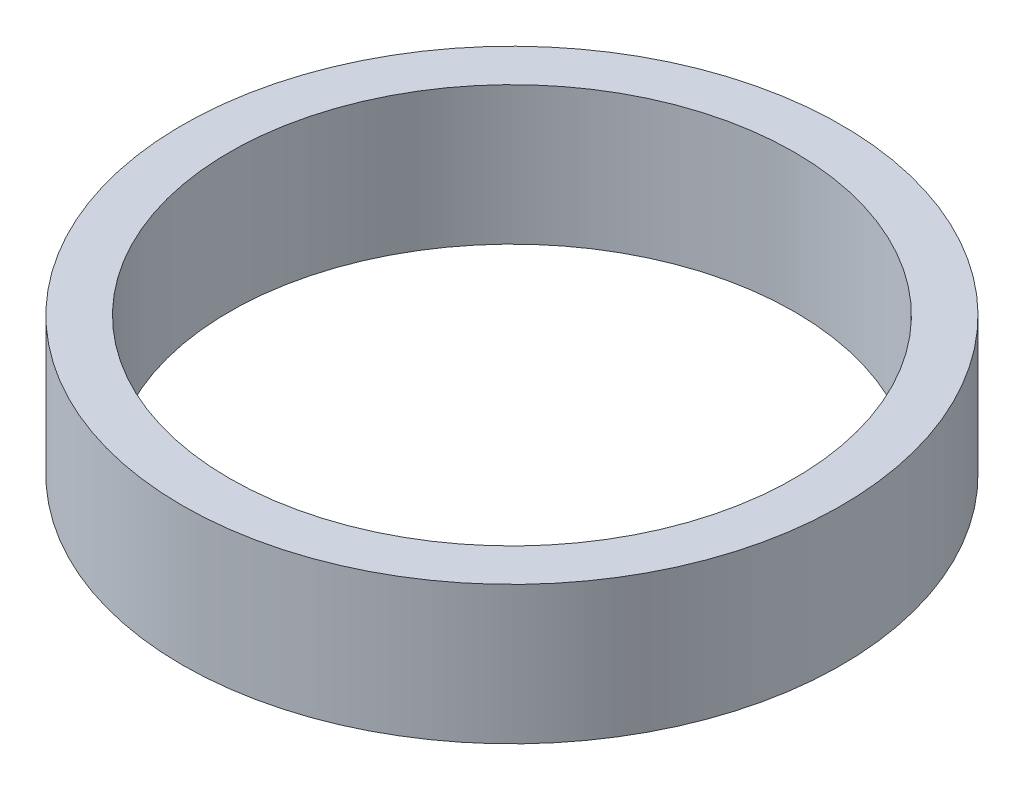
ISO-10303-21;
HEADER;
FILE_DESCRIPTION(('STEP AP214'),'2;1');
FILE_NAME('part.step','',(''),(''),'','','');
FILE_SCHEMA(('AUTOMOTIVE_DESIGN { 1 0 10303 214 1 1 1 1 }'));
ENDSEC;
DATA;
#1=APPLICATION_CONTEXT('core data for automotive mechanical design processes');
#2=APPLICATION_PROTOCOL_DEFINITION('international standard','automotive_design',2000,#1);
#3=PRODUCT_CONTEXT('',#1,'mechanical');
#4=PRODUCT('Part','Part','',(#3));
#5=PRODUCT_RELATED_PRODUCT_CATEGORY('part','',(#4));
#6=PRODUCT_DEFINITION_FORMATION('','',#4);
#7=PRODUCT_DEFINITION_CONTEXT('part definition',#1,'design');
#8=PRODUCT_DEFINITION('design','',#6,#7);
#9=PRODUCT_DEFINITION_SHAPE('','',#8);
#10=(LENGTH_UNIT() NAMED_UNIT(*) SI_UNIT(.MILLI.,.METRE.));
#11=(NAMED_UNIT(*) PLANE_ANGLE_UNIT() SI_UNIT($,.RADIAN.));
#12=(NAMED_UNIT(*) SI_UNIT($,.STERADIAN.) SOLID_ANGLE_UNIT());
#13=UNCERTAINTY_MEASURE_WITH_UNIT(LENGTH_MEASURE(1.E-05),#10,'distance_accuracy_value','');
#14=(GEOMETRIC_REPRESENTATION_CONTEXT(3) GLOBAL_UNCERTAINTY_ASSIGNED_CONTEXT((#13)) GLOBAL_UNIT_ASSIGNED_CONTEXT((#10,
#11,#12)) REPRESENTATION_CONTEXT('',''));
#15=CARTESIAN_POINT('',(0.,0.,0.));
#16=DIRECTION('',(0.,0.,1.));
#17=DIRECTION('',(1.,0.,0.));
#18=AXIS2_PLACEMENT_3D('',#15,#16,#17);
#19=CARTESIAN_POINT('',(0.,22.,0.));
#20=DIRECTION('',(0.,-1.,0.));
#21=DIRECTION('',(0.,0.,-1.));
#22=AXIS2_PLACEMENT_3D('',#19,#20,#21);
#23=CYLINDRICAL_SURFACE('',#22,52.5);
#24=CARTESIAN_POINT('',(0.,22.,0.));
#25=DIRECTION('',(0.,1.,0.));
#26=DIRECTION('',(0.,0.,1.));
#27=AXIS2_PLACEMENT_3D('',#24,#25,#26);
#28=CIRCLE('',#27,52.5);
#29=CARTESIAN_POINT('',(0.,22.,52.5));
#30=VERTEX_POINT('',#29);
#31=EDGE_CURVE('E10',#30,#30,#28,.T.);
#32=ORIENTED_EDGE('',*,*,#31,.F.);
#33=EDGE_LOOP('',(#32));
#34=FACE_BOUND('',#33,.T.);
#35=CARTESIAN_POINT('',(0.,0.,0.));
#36=DIRECTION('',(0.,1.,0.));
#37=DIRECTION('',(0.,0.,1.));
#38=AXIS2_PLACEMENT_3D('',#35,#36,#37);
#39=CIRCLE('',#38,52.5);
#40=CARTESIAN_POINT('',(0.,0.,52.5));
#41=VERTEX_POINT('',#40);
#42=EDGE_CURVE('E37',#41,#41,#39,.T.);
#43=ORIENTED_EDGE('',*,*,#42,.T.);
#44=EDGE_LOOP('',(#43));
#45=FACE_BOUND('',#44,.T.);
#46=ADVANCED_FACE('F40',(#34,#45),#23,.T.);
#47=CARTESIAN_POINT('',(0.,22.,0.));
#48=DIRECTION('',(0.,1.,0.));
#49=DIRECTION('',(0.,0.,1.));
#50=AXIS2_PLACEMENT_3D('',#47,#48,#49);
#51=PLANE('',#50);
#52=CARTESIAN_POINT('',(0.,22.,0.));
#53=DIRECTION('',(0.,1.,0.));
#54=DIRECTION('',(0.,0.,1.));
#55=AXIS2_PLACEMENT_3D('',#52,#53,#54);
#56=CIRCLE('',#55,45.);
#57=CARTESIAN_POINT('',(0.,22.,45.));
#58=VERTEX_POINT('',#57);
#59=EDGE_CURVE('E50',#58,#58,#56,.T.);
#60=ORIENTED_EDGE('',*,*,#59,.F.);
#61=EDGE_LOOP('',(#60));
#62=FACE_BOUND('',#61,.T.);
#63=ORIENTED_EDGE('',*,*,#31,.T.);
#64=EDGE_LOOP('',(#63));
#65=FACE_BOUND('',#64,.T.);
#66=ADVANCED_FACE('F59',(#62,#65),#51,.T.);
#67=CARTESIAN_POINT('',(0.,0.,0.));
#68=DIRECTION('',(0.,1.,0.));
#69=DIRECTION('',(0.,0.,1.));
#70=AXIS2_PLACEMENT_3D('',#67,#68,#69);
#71=PLANE('',#70);
#72=CARTESIAN_POINT('',(0.,0.,0.));
#73=DIRECTION('',(0.,1.,0.));
#74=DIRECTION('',(0.,0.,1.));
#75=AXIS2_PLACEMENT_3D('',#72,#73,#74);
#76=CIRCLE('',#75,45.);
#77=CARTESIAN_POINT('',(0.,0.,45.));
#78=VERTEX_POINT('',#77);
#79=EDGE_CURVE('E47',#78,#78,#76,.T.);
#80=ORIENTED_EDGE('',*,*,#79,.T.);
#81=EDGE_LOOP('',(#80));
#82=FACE_BOUND('',#81,.T.);
#83=ORIENTED_EDGE('',*,*,#42,.F.);
#84=EDGE_LOOP('',(#83));
#85=FACE_BOUND('',#84,.T.);
#86=ADVANCED_FACE('F58',(#82,#85),#71,.F.);
#87=CARTESIAN_POINT('',(0.,22.,0.));
#88=DIRECTION('',(0.,-1.,0.));
#89=DIRECTION('',(0.,0.,-1.));
#90=AXIS2_PLACEMENT_3D('',#87,#88,#89);
#91=CYLINDRICAL_SURFACE('',#90,45.);
#92=ORIENTED_EDGE('',*,*,#59,.T.);
#93=EDGE_LOOP('',(#92));
#94=FACE_BOUND('',#93,.T.);
#95=ORIENTED_EDGE('',*,*,#79,.F.);
#96=EDGE_LOOP('',(#95));
#97=FACE_BOUND('',#96,.T.);
#98=ADVANCED_FACE('F54',(#94,#97),#91,.F.);
#99=CLOSED_SHELL('',(#46,#66,#86,#98));
#100=MANIFOLD_SOLID_BREP('B2',#99);
#101=ADVANCED_BREP_SHAPE_REPRESENTATION('',(#18,#100),#14);
#102=SHAPE_DEFINITION_REPRESENTATION(#9,#101);
ENDSEC;
END-ISO-10303-21;
